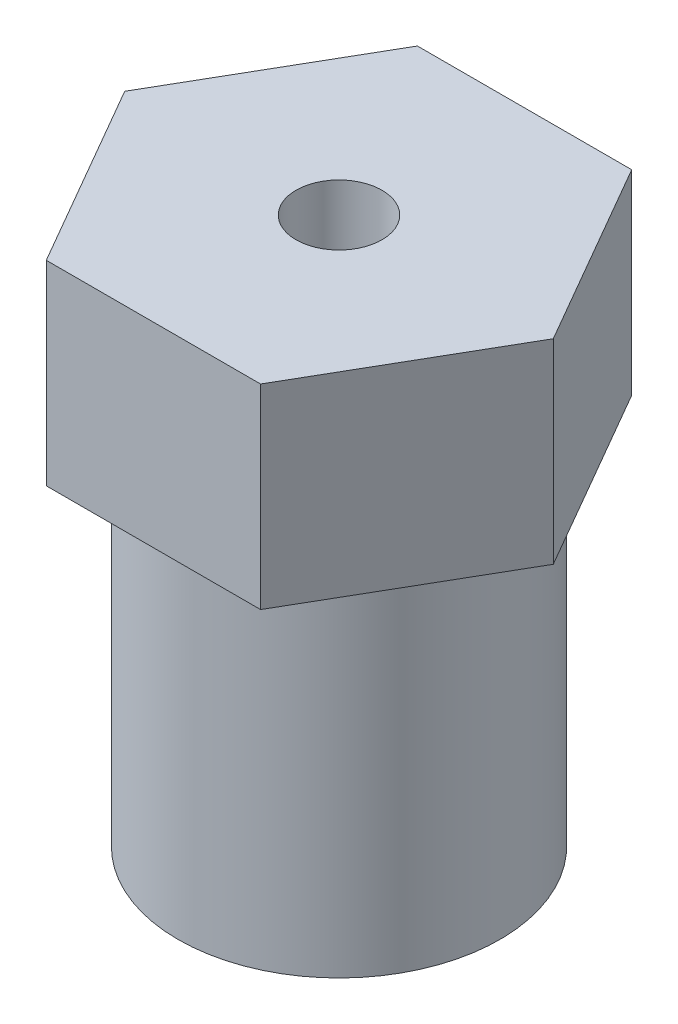
ISO-10303-21;
HEADER;
FILE_DESCRIPTION(('STEP AP214'),'2;1');
FILE_NAME('part.step','',(''),(''),'','','');
FILE_SCHEMA(('AUTOMOTIVE_DESIGN { 1 0 10303 214 1 1 1 1 }'));
ENDSEC;
DATA;
#1=APPLICATION_CONTEXT('core data for automotive mechanical design processes');
#2=APPLICATION_PROTOCOL_DEFINITION('international standard','automotive_design',2000,#1);
#3=PRODUCT_CONTEXT('',#1,'mechanical');
#4=PRODUCT('Part','Part','',(#3));
#5=PRODUCT_RELATED_PRODUCT_CATEGORY('part','',(#4));
#6=PRODUCT_DEFINITION_FORMATION('','',#4);
#7=PRODUCT_DEFINITION_CONTEXT('part definition',#1,'design');
#8=PRODUCT_DEFINITION('design','',#6,#7);
#9=PRODUCT_DEFINITION_SHAPE('','',#8);
#10=(LENGTH_UNIT() NAMED_UNIT(*) SI_UNIT(.MILLI.,.METRE.));
#11=(NAMED_UNIT(*) PLANE_ANGLE_UNIT() SI_UNIT($,.RADIAN.));
#12=(NAMED_UNIT(*) SI_UNIT($,.STERADIAN.) SOLID_ANGLE_UNIT());
#13=UNCERTAINTY_MEASURE_WITH_UNIT(LENGTH_MEASURE(1.E-05),#10,'distance_accuracy_value','');
#14=(GEOMETRIC_REPRESENTATION_CONTEXT(3) GLOBAL_UNCERTAINTY_ASSIGNED_CONTEXT((#13)) GLOBAL_UNIT_ASSIGNED_CONTEXT((#10,
#11,#12)) REPRESENTATION_CONTEXT('',''));
#15=CARTESIAN_POINT('',(0.,0.,0.));
#16=DIRECTION('',(0.,0.,1.));
#17=DIRECTION('',(1.,0.,0.));
#18=AXIS2_PLACEMENT_3D('',#15,#16,#17);
#19=CARTESIAN_POINT('',(0.,11.43,0.));
#20=DIRECTION('',(0.,-1.,0.));
#21=DIRECTION('',(0.,0.,-1.));
#22=AXIS2_PLACEMENT_3D('',#19,#20,#21);
#23=CYLINDRICAL_SURFACE('',#22,5.2324);
#24=CARTESIAN_POINT('',(0.,11.43,0.));
#25=DIRECTION('',(0.,1.,0.));
#26=DIRECTION('',(0.,0.,1.));
#27=AXIS2_PLACEMENT_3D('',#24,#25,#26);
#28=CIRCLE('',#27,5.2324);
#29=CARTESIAN_POINT('',(0.,11.43,5.2324));
#30=VERTEX_POINT('',#29);
#31=EDGE_CURVE('E11',#30,#30,#28,.T.);
#32=ORIENTED_EDGE('',*,*,#31,.F.);
#33=EDGE_LOOP('',(#32));
#34=FACE_BOUND('',#33,.T.);
#35=CARTESIAN_POINT('',(0.,0.,0.));
#36=DIRECTION('',(0.,1.,0.));
#37=DIRECTION('',(0.,0.,1.));
#38=AXIS2_PLACEMENT_3D('',#35,#36,#37);
#39=CIRCLE('',#38,5.2324);
#40=CARTESIAN_POINT('',(0.,0.,5.2324));
#41=VERTEX_POINT('',#40);
#42=EDGE_CURVE('E38',#41,#41,#39,.T.);
#43=ORIENTED_EDGE('',*,*,#42,.T.);
#44=EDGE_LOOP('',(#43));
#45=FACE_BOUND('',#44,.T.);
#46=ADVANCED_FACE('F35',(#34,#45),#23,.T.);
#47=CARTESIAN_POINT('',(0.,0.,0.));
#48=DIRECTION('',(0.,1.,0.));
#49=DIRECTION('',(0.,0.,1.));
#50=AXIS2_PLACEMENT_3D('',#47,#48,#49);
#51=PLANE('',#50);
#52=CARTESIAN_POINT('',(0.,0.,0.));
#53=DIRECTION('',(0.,1.,0.));
#54=DIRECTION('',(0.,0.,1.));
#55=AXIS2_PLACEMENT_3D('',#52,#53,#54);
#56=CIRCLE('',#55,1.397);
#57=CARTESIAN_POINT('',(0.,0.,1.397));
#58=VERTEX_POINT('',#57);
#59=EDGE_CURVE('E124',#58,#58,#56,.T.);
#60=ORIENTED_EDGE('',*,*,#59,.T.);
#61=EDGE_LOOP('',(#60));
#62=FACE_BOUND('',#61,.T.);
#63=ORIENTED_EDGE('',*,*,#42,.F.);
#64=EDGE_LOOP('',(#63));
#65=FACE_BOUND('',#64,.T.);
#66=ADVANCED_FACE('F144',(#62,#65),#51,.F.);
#67=CARTESIAN_POINT('',(3.48286549888642,17.78,6.0325));
#68=DIRECTION('',(-0.866025403784439,0.,-0.5));
#69=DIRECTION('',(-0.5,0.,0.866025403784439));
#70=AXIS2_PLACEMENT_3D('',#67,#68,#69);
#71=PLANE('',#70);
#72=DIRECTION('',(0.5,0.,-0.866025403784439));
#73=VECTOR('',#72,1.);
#74=CARTESIAN_POINT('',(3.48286549888642,11.43,6.0325));
#75=LINE('',#74,#73);
#76=CARTESIAN_POINT('',(3.48286549888642,11.43,6.0325));
#77=VERTEX_POINT('',#76);
#78=CARTESIAN_POINT('',(6.96573099777283,11.43,0.));
#79=VERTEX_POINT('',#78);
#80=EDGE_CURVE('E120',#77,#79,#75,.T.);
#81=ORIENTED_EDGE('',*,*,#80,.T.);
#82=DIRECTION('',(0.,-1.,0.));
#83=VECTOR('',#82,1.);
#84=CARTESIAN_POINT('',(6.96573099777283,17.78,0.));
#85=LINE('',#84,#83);
#86=CARTESIAN_POINT('',(6.96573099777283,17.78,0.));
#87=VERTEX_POINT('',#86);
#88=EDGE_CURVE('E138',#87,#79,#85,.T.);
#89=ORIENTED_EDGE('',*,*,#88,.F.);
#90=DIRECTION('',(0.5,0.,-0.866025403784439));
#91=VECTOR('',#90,1.);
#92=CARTESIAN_POINT('',(3.48286549888642,17.78,6.0325));
#93=LINE('',#92,#91);
#94=CARTESIAN_POINT('',(3.48286549888642,17.78,6.0325));
#95=VERTEX_POINT('',#94);
#96=EDGE_CURVE('E131',#95,#87,#93,.T.);
#97=ORIENTED_EDGE('',*,*,#96,.F.);
#98=DIRECTION('',(0.,-1.,0.));
#99=VECTOR('',#98,1.);
#100=CARTESIAN_POINT('',(3.48286549888642,17.78,6.0325));
#101=LINE('',#100,#99);
#102=EDGE_CURVE('E116',#95,#77,#101,.T.);
#103=ORIENTED_EDGE('',*,*,#102,.T.);
#104=EDGE_LOOP('',(#81,#89,#97,#103));
#105=FACE_BOUND('',#104,.T.);
#106=ADVANCED_FACE('F146',(#105),#71,.F.);
#107=CARTESIAN_POINT('',(6.96573099777283,17.78,0.));
#108=DIRECTION('',(-0.866025403784438,0.,0.5));
#109=DIRECTION('',(0.5,0.,0.866025403784439));
#110=AXIS2_PLACEMENT_3D('',#107,#108,#109);
#111=PLANE('',#110);
#112=DIRECTION('',(-0.5,0.,-0.866025403784438));
#113=VECTOR('',#112,1.);
#114=CARTESIAN_POINT('',(6.96573099777283,11.43,0.));
#115=LINE('',#114,#113);
#116=CARTESIAN_POINT('',(3.48286549888641,11.43,-6.0325));
#117=VERTEX_POINT('',#116);
#118=EDGE_CURVE('E123',#79,#117,#115,.T.);
#119=ORIENTED_EDGE('',*,*,#118,.T.);
#120=DIRECTION('',(0.,-1.,0.));
#121=VECTOR('',#120,1.);
#122=CARTESIAN_POINT('',(3.48286549888641,17.78,-6.0325));
#123=LINE('',#122,#121);
#124=CARTESIAN_POINT('',(3.48286549888641,17.78,-6.0325));
#125=VERTEX_POINT('',#124);
#126=EDGE_CURVE('E135',#125,#117,#123,.T.);
#127=ORIENTED_EDGE('',*,*,#126,.F.);
#128=DIRECTION('',(-0.5,0.,-0.866025403784438));
#129=VECTOR('',#128,1.);
#130=CARTESIAN_POINT('',(6.96573099777283,17.78,0.));
#131=LINE('',#130,#129);
#132=EDGE_CURVE('E89',#87,#125,#131,.T.);
#133=ORIENTED_EDGE('',*,*,#132,.F.);
#134=ORIENTED_EDGE('',*,*,#88,.T.);
#135=EDGE_LOOP('',(#119,#127,#133,#134));
#136=FACE_BOUND('',#135,.T.);
#137=ADVANCED_FACE('F152',(#136),#111,.F.);
#138=CARTESIAN_POINT('',(3.48286549888641,17.78,-6.0325));
#139=DIRECTION('',(0.,0.,1.));
#140=DIRECTION('',(1.,0.,0.));
#141=AXIS2_PLACEMENT_3D('',#138,#139,#140);
#142=PLANE('',#141);
#143=DIRECTION('',(-1.,0.,0.));
#144=VECTOR('',#143,1.);
#145=CARTESIAN_POINT('',(3.48286549888641,11.43,-6.0325));
#146=LINE('',#145,#144);
#147=CARTESIAN_POINT('',(-3.48286549888642,11.43,-6.0325));
#148=VERTEX_POINT('',#147);
#149=EDGE_CURVE('E126',#117,#148,#146,.T.);
#150=ORIENTED_EDGE('',*,*,#149,.T.);
#151=DIRECTION('',(0.,-1.,0.));
#152=VECTOR('',#151,1.);
#153=CARTESIAN_POINT('',(-3.48286549888642,17.78,-6.0325));
#154=LINE('',#153,#152);
#155=CARTESIAN_POINT('',(-3.48286549888642,17.78,-6.0325));
#156=VERTEX_POINT('',#155);
#157=EDGE_CURVE('E111',#156,#148,#154,.T.);
#158=ORIENTED_EDGE('',*,*,#157,.F.);
#159=DIRECTION('',(-1.,0.,0.));
#160=VECTOR('',#159,1.);
#161=CARTESIAN_POINT('',(3.48286549888641,17.78,-6.0325));
#162=LINE('',#161,#160);
#163=EDGE_CURVE('E102',#125,#156,#162,.T.);
#164=ORIENTED_EDGE('',*,*,#163,.F.);
#165=ORIENTED_EDGE('',*,*,#126,.T.);
#166=EDGE_LOOP('',(#150,#158,#164,#165));
#167=FACE_BOUND('',#166,.T.);
#168=ADVANCED_FACE('F160',(#167),#142,.F.);
#169=CARTESIAN_POINT('',(-3.48286549888642,17.78,-6.0325));
#170=DIRECTION('',(0.866025403784439,0.,0.5));
#171=DIRECTION('',(0.5,0.,-0.866025403784439));
#172=AXIS2_PLACEMENT_3D('',#169,#170,#171);
#173=PLANE('',#172);
#174=DIRECTION('',(-0.5,0.,0.866025403784439));
#175=VECTOR('',#174,1.);
#176=CARTESIAN_POINT('',(-3.48286549888642,11.43,-6.0325));
#177=LINE('',#176,#175);
#178=CARTESIAN_POINT('',(-6.96573099777284,11.43,0.));
#179=VERTEX_POINT('',#178);
#180=EDGE_CURVE('E110',#148,#179,#177,.T.);
#181=ORIENTED_EDGE('',*,*,#180,.T.);
#182=DIRECTION('',(0.,-1.,0.));
#183=VECTOR('',#182,1.);
#184=CARTESIAN_POINT('',(-6.96573099777284,17.78,0.));
#185=LINE('',#184,#183);
#186=CARTESIAN_POINT('',(-6.96573099777284,17.78,0.));
#187=VERTEX_POINT('',#186);
#188=EDGE_CURVE('E107',#187,#179,#185,.T.);
#189=ORIENTED_EDGE('',*,*,#188,.F.);
#190=DIRECTION('',(-0.5,0.,0.866025403784439));
#191=VECTOR('',#190,1.);
#192=CARTESIAN_POINT('',(-3.48286549888642,17.78,-6.0325));
#193=LINE('',#192,#191);
#194=EDGE_CURVE('E96',#156,#187,#193,.T.);
#195=ORIENTED_EDGE('',*,*,#194,.F.);
#196=ORIENTED_EDGE('',*,*,#157,.T.);
#197=EDGE_LOOP('',(#181,#189,#195,#196));
#198=FACE_BOUND('',#197,.T.);
#199=ADVANCED_FACE('F108',(#198),#173,.F.);
#200=CARTESIAN_POINT('',(-6.96573099777284,17.78,0.));
#201=DIRECTION('',(0.866025403784438,0.,-0.5));
#202=DIRECTION('',(-0.5,0.,-0.866025403784439));
#203=AXIS2_PLACEMENT_3D('',#200,#201,#202);
#204=PLANE('',#203);
#205=DIRECTION('',(0.5,0.,0.866025403784438));
#206=VECTOR('',#205,1.);
#207=CARTESIAN_POINT('',(-6.96573099777284,11.43,0.));
#208=LINE('',#207,#206);
#209=CARTESIAN_POINT('',(-3.48286549888642,11.43,6.0325));
#210=VERTEX_POINT('',#209);
#211=EDGE_CURVE('E74',#179,#210,#208,.T.);
#212=ORIENTED_EDGE('',*,*,#211,.T.);
#213=DIRECTION('',(0.,-1.,0.));
#214=VECTOR('',#213,1.);
#215=CARTESIAN_POINT('',(-3.48286549888642,17.78,6.0325));
#216=LINE('',#215,#214);
#217=CARTESIAN_POINT('',(-3.48286549888642,17.78,6.0325));
#218=VERTEX_POINT('',#217);
#219=EDGE_CURVE('E112',#218,#210,#216,.T.);
#220=ORIENTED_EDGE('',*,*,#219,.F.);
#221=DIRECTION('',(0.5,0.,0.866025403784438));
#222=VECTOR('',#221,1.);
#223=CARTESIAN_POINT('',(-6.96573099777284,17.78,0.));
#224=LINE('',#223,#222);
#225=EDGE_CURVE('E100',#187,#218,#224,.T.);
#226=ORIENTED_EDGE('',*,*,#225,.F.);
#227=ORIENTED_EDGE('',*,*,#188,.T.);
#228=EDGE_LOOP('',(#212,#220,#226,#227));
#229=FACE_BOUND('',#228,.T.);
#230=ADVANCED_FACE('F114',(#229),#204,.F.);
#231=CARTESIAN_POINT('',(-3.48286549888642,17.78,6.0325));
#232=DIRECTION('',(0.,0.,-1.));
#233=DIRECTION('',(-1.,0.,0.));
#234=AXIS2_PLACEMENT_3D('',#231,#232,#233);
#235=PLANE('',#234);
#236=DIRECTION('',(1.,0.,0.));
#237=VECTOR('',#236,1.);
#238=CARTESIAN_POINT('',(-3.48286549888642,11.43,6.0325));
#239=LINE('',#238,#237);
#240=EDGE_CURVE('E80',#210,#77,#239,.T.);
#241=ORIENTED_EDGE('',*,*,#240,.T.);
#242=ORIENTED_EDGE('',*,*,#102,.F.);
#243=DIRECTION('',(1.,0.,0.));
#244=VECTOR('',#243,1.);
#245=CARTESIAN_POINT('',(-3.48286549888642,17.78,6.0325));
#246=LINE('',#245,#244);
#247=EDGE_CURVE('E51',#218,#95,#246,.T.);
#248=ORIENTED_EDGE('',*,*,#247,.F.);
#249=ORIENTED_EDGE('',*,*,#219,.T.);
#250=EDGE_LOOP('',(#241,#242,#248,#249));
#251=FACE_BOUND('',#250,.T.);
#252=ADVANCED_FACE('F168',(#251),#235,.F.);
#253=CARTESIAN_POINT('',(0.,17.78,0.));
#254=DIRECTION('',(0.,1.,0.));
#255=DIRECTION('',(0.,0.,1.));
#256=AXIS2_PLACEMENT_3D('',#253,#254,#255);
#257=PLANE('',#256);
#258=CARTESIAN_POINT('',(0.,17.78,0.));
#259=DIRECTION('',(0.,1.,0.));
#260=DIRECTION('',(0.,0.,1.));
#261=AXIS2_PLACEMENT_3D('',#258,#259,#260);
#262=CIRCLE('',#261,1.397);
#263=CARTESIAN_POINT('',(0.,17.78,1.397));
#264=VERTEX_POINT('',#263);
#265=EDGE_CURVE('E187',#264,#264,#262,.T.);
#266=ORIENTED_EDGE('',*,*,#265,.F.);
#267=EDGE_LOOP('',(#266));
#268=FACE_BOUND('',#267,.T.);
#269=ORIENTED_EDGE('',*,*,#96,.T.);
#270=ORIENTED_EDGE('',*,*,#132,.T.);
#271=ORIENTED_EDGE('',*,*,#163,.T.);
#272=ORIENTED_EDGE('',*,*,#194,.T.);
#273=ORIENTED_EDGE('',*,*,#225,.T.);
#274=ORIENTED_EDGE('',*,*,#247,.T.);
#275=EDGE_LOOP('',(#269,#270,#271,#272,#273,#274));
#276=FACE_BOUND('',#275,.T.);
#277=ADVANCED_FACE('F98',(#268,#276),#257,.T.);
#278=CARTESIAN_POINT('',(0.,11.43,0.));
#279=DIRECTION('',(0.,1.,0.));
#280=DIRECTION('',(0.,0.,1.));
#281=AXIS2_PLACEMENT_3D('',#278,#279,#280);
#282=PLANE('',#281);
#283=ORIENTED_EDGE('',*,*,#31,.T.);
#284=EDGE_LOOP('',(#283));
#285=FACE_BOUND('',#284,.T.);
#286=ORIENTED_EDGE('',*,*,#80,.F.);
#287=ORIENTED_EDGE('',*,*,#240,.F.);
#288=ORIENTED_EDGE('',*,*,#211,.F.);
#289=ORIENTED_EDGE('',*,*,#180,.F.);
#290=ORIENTED_EDGE('',*,*,#149,.F.);
#291=ORIENTED_EDGE('',*,*,#118,.F.);
#292=EDGE_LOOP('',(#286,#287,#288,#289,#290,#291));
#293=FACE_BOUND('',#292,.T.);
#294=ADVANCED_FACE('F171',(#285,#293),#282,.F.);
#295=CARTESIAN_POINT('',(0.,0.,0.));
#296=DIRECTION('',(0.,1.,0.));
#297=DIRECTION('',(0.,0.,1.));
#298=AXIS2_PLACEMENT_3D('',#295,#296,#297);
#299=CYLINDRICAL_SURFACE('',#298,1.397);
#300=ORIENTED_EDGE('',*,*,#59,.F.);
#301=EDGE_LOOP('',(#300));
#302=FACE_BOUND('',#301,.T.);
#303=ORIENTED_EDGE('',*,*,#265,.T.);
#304=EDGE_LOOP('',(#303));
#305=FACE_BOUND('',#304,.T.);
#306=ADVANCED_FACE('F174',(#302,#305),#299,.F.);
#307=CLOSED_SHELL('',(#46,#66,#106,#137,#168,#199,#230,#252,#277,#294,#306));
#308=MANIFOLD_SOLID_BREP('B2',#307);
#309=ADVANCED_BREP_SHAPE_REPRESENTATION('',(#18,#308),#14);
#310=SHAPE_DEFINITION_REPRESENTATION(#9,#309);
ENDSEC;
END-ISO-10303-21;
